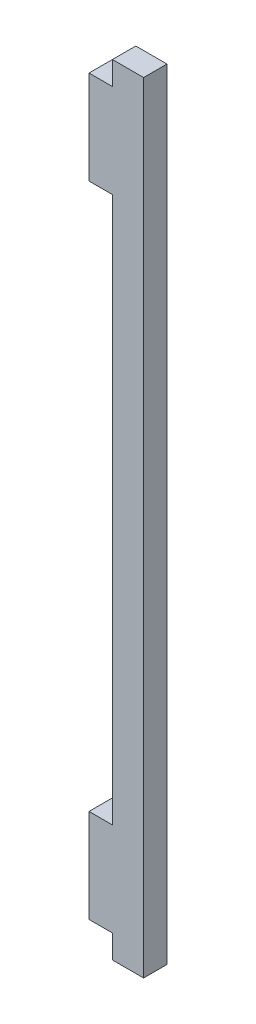
ISO-10303-21;
HEADER;
FILE_DESCRIPTION(('STEP AP214'),'2;1');
FILE_NAME('part.step','',(''),(''),'','','');
FILE_SCHEMA(('AUTOMOTIVE_DESIGN { 1 0 10303 214 1 1 1 1 }'));
ENDSEC;
DATA;
#1=APPLICATION_CONTEXT('core data for automotive mechanical design processes');
#2=APPLICATION_PROTOCOL_DEFINITION('international standard','automotive_design',2000,#1);
#3=PRODUCT_CONTEXT('',#1,'mechanical');
#4=PRODUCT('Part','Part','',(#3));
#5=PRODUCT_RELATED_PRODUCT_CATEGORY('part','',(#4));
#6=PRODUCT_DEFINITION_FORMATION('','',#4);
#7=PRODUCT_DEFINITION_CONTEXT('part definition',#1,'design');
#8=PRODUCT_DEFINITION('design','',#6,#7);
#9=PRODUCT_DEFINITION_SHAPE('','',#8);
#10=(LENGTH_UNIT() NAMED_UNIT(*) SI_UNIT(.MILLI.,.METRE.));
#11=(NAMED_UNIT(*) PLANE_ANGLE_UNIT() SI_UNIT($,.RADIAN.));
#12=(NAMED_UNIT(*) SI_UNIT($,.STERADIAN.) SOLID_ANGLE_UNIT());
#13=UNCERTAINTY_MEASURE_WITH_UNIT(LENGTH_MEASURE(1.E-05),#10,'distance_accuracy_value','');
#14=(GEOMETRIC_REPRESENTATION_CONTEXT(3) GLOBAL_UNCERTAINTY_ASSIGNED_CONTEXT((#13)) GLOBAL_UNIT_ASSIGNED_CONTEXT((#10,
#11,#12)) REPRESENTATION_CONTEXT('',''));
#15=CARTESIAN_POINT('',(0.,0.,0.));
#16=DIRECTION('',(0.,0.,1.));
#17=DIRECTION('',(1.,0.,0.));
#18=AXIS2_PLACEMENT_3D('',#15,#16,#17);
#19=CARTESIAN_POINT('',(0.,0.,3.));
#20=DIRECTION('',(1.,0.,0.));
#21=DIRECTION('',(0.,1.,0.));
#22=AXIS2_PLACEMENT_3D('',#19,#20,#21);
#23=PLANE('',#22);
#24=DIRECTION('',(0.,-1.,0.));
#25=VECTOR('',#24,1.);
#26=CARTESIAN_POINT('',(0.,0.,0.));
#27=LINE('',#26,#25);
#28=CARTESIAN_POINT('',(0.,3.,0.));
#29=VERTEX_POINT('',#28);
#30=CARTESIAN_POINT('',(0.,0.,0.));
#31=VERTEX_POINT('',#30);
#32=EDGE_CURVE('E153',#29,#31,#27,.T.);
#33=ORIENTED_EDGE('',*,*,#32,.T.);
#34=DIRECTION('',(0.,0.,-1.));
#35=VECTOR('',#34,1.);
#36=CARTESIAN_POINT('',(0.,0.,3.));
#37=LINE('',#36,#35);
#38=CARTESIAN_POINT('',(0.,0.,3.));
#39=VERTEX_POINT('',#38);
#40=EDGE_CURVE('E11',#39,#31,#37,.T.);
#41=ORIENTED_EDGE('',*,*,#40,.F.);
#42=DIRECTION('',(0.,-1.,0.));
#43=VECTOR('',#42,1.);
#44=CARTESIAN_POINT('',(0.,0.,3.));
#45=LINE('',#44,#43);
#46=CARTESIAN_POINT('',(0.,3.,3.));
#47=VERTEX_POINT('',#46);
#48=EDGE_CURVE('E175',#47,#39,#45,.T.);
#49=ORIENTED_EDGE('',*,*,#48,.F.);
#50=DIRECTION('',(0.,0.,-1.));
#51=VECTOR('',#50,1.);
#52=CARTESIAN_POINT('',(0.,3.,3.));
#53=LINE('',#52,#51);
#54=EDGE_CURVE('E149',#47,#29,#53,.T.);
#55=ORIENTED_EDGE('',*,*,#54,.T.);
#56=EDGE_LOOP('',(#33,#41,#49,#55));
#57=FACE_BOUND('',#56,.T.);
#58=ADVANCED_FACE('F33',(#57),#23,.F.);
#59=CARTESIAN_POINT('',(0.,0.,3.));
#60=DIRECTION('',(0.,1.,0.));
#61=DIRECTION('',(0.,0.,1.));
#62=AXIS2_PLACEMENT_3D('',#59,#60,#61);
#63=PLANE('',#62);
#64=DIRECTION('',(1.,0.,0.));
#65=VECTOR('',#64,1.);
#66=CARTESIAN_POINT('',(0.,0.,0.));
#67=LINE('',#66,#65);
#68=CARTESIAN_POINT('',(4.,0.,0.));
#69=VERTEX_POINT('',#68);
#70=EDGE_CURVE('E156',#31,#69,#67,.T.);
#71=ORIENTED_EDGE('',*,*,#70,.T.);
#72=DIRECTION('',(0.,0.,-1.));
#73=VECTOR('',#72,1.);
#74=CARTESIAN_POINT('',(4.,0.,3.));
#75=LINE('',#74,#73);
#76=CARTESIAN_POINT('',(4.,0.,3.));
#77=VERTEX_POINT('',#76);
#78=EDGE_CURVE('E41',#77,#69,#75,.T.);
#79=ORIENTED_EDGE('',*,*,#78,.F.);
#80=DIRECTION('',(1.,0.,0.));
#81=VECTOR('',#80,1.);
#82=CARTESIAN_POINT('',(0.,0.,3.));
#83=LINE('',#82,#81);
#84=EDGE_CURVE('E104',#39,#77,#83,.T.);
#85=ORIENTED_EDGE('',*,*,#84,.F.);
#86=ORIENTED_EDGE('',*,*,#40,.T.);
#87=EDGE_LOOP('',(#71,#79,#85,#86));
#88=FACE_BOUND('',#87,.T.);
#89=ADVANCED_FACE('F253',(#88),#63,.F.);
#90=CARTESIAN_POINT('',(4.,0.,3.));
#91=DIRECTION('',(-1.,0.,0.));
#92=DIRECTION('',(0.,0.,1.));
#93=AXIS2_PLACEMENT_3D('',#90,#91,#92);
#94=PLANE('',#93);
#95=DIRECTION('',(0.,1.,0.));
#96=VECTOR('',#95,1.);
#97=CARTESIAN_POINT('',(4.,0.,0.));
#98=LINE('',#97,#96);
#99=CARTESIAN_POINT('',(4.,100.,0.));
#100=VERTEX_POINT('',#99);
#101=EDGE_CURVE('E158',#69,#100,#98,.T.);
#102=ORIENTED_EDGE('',*,*,#101,.T.);
#103=DIRECTION('',(0.,0.,-1.));
#104=VECTOR('',#103,1.);
#105=CARTESIAN_POINT('',(4.,100.,3.));
#106=LINE('',#105,#104);
#107=CARTESIAN_POINT('',(4.,100.,3.));
#108=VERTEX_POINT('',#107);
#109=EDGE_CURVE('E194',#108,#100,#106,.T.);
#110=ORIENTED_EDGE('',*,*,#109,.F.);
#111=DIRECTION('',(0.,1.,0.));
#112=VECTOR('',#111,1.);
#113=CARTESIAN_POINT('',(4.,0.,3.));
#114=LINE('',#113,#112);
#115=EDGE_CURVE('E202',#77,#108,#114,.T.);
#116=ORIENTED_EDGE('',*,*,#115,.F.);
#117=ORIENTED_EDGE('',*,*,#78,.T.);
#118=EDGE_LOOP('',(#102,#110,#116,#117));
#119=FACE_BOUND('',#118,.T.);
#120=ADVANCED_FACE('F200',(#119),#94,.F.);
#121=CARTESIAN_POINT('',(0.,100.,3.));
#122=DIRECTION('',(0.,-1.,0.));
#123=DIRECTION('',(0.,0.,-1.));
#124=AXIS2_PLACEMENT_3D('',#121,#122,#123);
#125=PLANE('',#124);
#126=DIRECTION('',(-1.,0.,0.));
#127=VECTOR('',#126,1.);
#128=CARTESIAN_POINT('',(0.,100.,0.));
#129=LINE('',#128,#127);
#130=CARTESIAN_POINT('',(0.,100.,0.));
#131=VERTEX_POINT('',#130);
#132=EDGE_CURVE('E160',#100,#131,#129,.T.);
#133=ORIENTED_EDGE('',*,*,#132,.T.);
#134=DIRECTION('',(0.,0.,-1.));
#135=VECTOR('',#134,1.);
#136=CARTESIAN_POINT('',(0.,100.,3.));
#137=LINE('',#136,#135);
#138=CARTESIAN_POINT('',(0.,100.,3.));
#139=VERTEX_POINT('',#138);
#140=EDGE_CURVE('E191',#139,#131,#137,.T.);
#141=ORIENTED_EDGE('',*,*,#140,.F.);
#142=DIRECTION('',(-1.,0.,0.));
#143=VECTOR('',#142,1.);
#144=CARTESIAN_POINT('',(0.,100.,3.));
#145=LINE('',#144,#143);
#146=EDGE_CURVE('E220',#108,#139,#145,.T.);
#147=ORIENTED_EDGE('',*,*,#146,.F.);
#148=ORIENTED_EDGE('',*,*,#109,.T.);
#149=EDGE_LOOP('',(#133,#141,#147,#148));
#150=FACE_BOUND('',#149,.T.);
#151=ADVANCED_FACE('F211',(#150),#125,.F.);
#152=CARTESIAN_POINT('',(0.,97.,3.));
#153=DIRECTION('',(1.,0.,0.));
#154=DIRECTION('',(0.,1.,0.));
#155=AXIS2_PLACEMENT_3D('',#152,#153,#154);
#156=PLANE('',#155);
#157=DIRECTION('',(0.,-1.,0.));
#158=VECTOR('',#157,1.);
#159=CARTESIAN_POINT('',(0.,97.,0.));
#160=LINE('',#159,#158);
#161=CARTESIAN_POINT('',(0.,97.,0.));
#162=VERTEX_POINT('',#161);
#163=EDGE_CURVE('E162',#131,#162,#160,.T.);
#164=ORIENTED_EDGE('',*,*,#163,.T.);
#165=DIRECTION('',(0.,0.,-1.));
#166=VECTOR('',#165,1.);
#167=CARTESIAN_POINT('',(0.,97.,3.));
#168=LINE('',#167,#166);
#169=CARTESIAN_POINT('',(0.,97.,3.));
#170=VERTEX_POINT('',#169);
#171=EDGE_CURVE('E188',#170,#162,#168,.T.);
#172=ORIENTED_EDGE('',*,*,#171,.F.);
#173=DIRECTION('',(0.,-1.,0.));
#174=VECTOR('',#173,1.);
#175=CARTESIAN_POINT('',(0.,97.,3.));
#176=LINE('',#175,#174);
#177=EDGE_CURVE('E217',#139,#170,#176,.T.);
#178=ORIENTED_EDGE('',*,*,#177,.F.);
#179=ORIENTED_EDGE('',*,*,#140,.T.);
#180=EDGE_LOOP('',(#164,#172,#178,#179));
#181=FACE_BOUND('',#180,.T.);
#182=ADVANCED_FACE('F215',(#181),#156,.F.);
#183=CARTESIAN_POINT('',(0.,97.,3.));
#184=DIRECTION('',(0.,-1.,0.));
#185=DIRECTION('',(0.,0.,-1.));
#186=AXIS2_PLACEMENT_3D('',#183,#184,#185);
#187=PLANE('',#186);
#188=DIRECTION('',(-1.,0.,0.));
#189=VECTOR('',#188,1.);
#190=CARTESIAN_POINT('',(0.,97.,0.));
#191=LINE('',#190,#189);
#192=CARTESIAN_POINT('',(-3.,97.,0.));
#193=VERTEX_POINT('',#192);
#194=EDGE_CURVE('E164',#162,#193,#191,.T.);
#195=ORIENTED_EDGE('',*,*,#194,.T.);
#196=DIRECTION('',(0.,0.,-1.));
#197=VECTOR('',#196,1.);
#198=CARTESIAN_POINT('',(-3.,97.,3.));
#199=LINE('',#198,#197);
#200=CARTESIAN_POINT('',(-3.,97.,3.));
#201=VERTEX_POINT('',#200);
#202=EDGE_CURVE('E185',#201,#193,#199,.T.);
#203=ORIENTED_EDGE('',*,*,#202,.F.);
#204=DIRECTION('',(-1.,0.,0.));
#205=VECTOR('',#204,1.);
#206=CARTESIAN_POINT('',(0.,97.,3.));
#207=LINE('',#206,#205);
#208=EDGE_CURVE('E219',#170,#201,#207,.T.);
#209=ORIENTED_EDGE('',*,*,#208,.F.);
#210=ORIENTED_EDGE('',*,*,#171,.T.);
#211=EDGE_LOOP('',(#195,#203,#209,#210));
#212=FACE_BOUND('',#211,.T.);
#213=ADVANCED_FACE('F266',(#212),#187,.F.);
#214=CARTESIAN_POINT('',(-3.,97.,3.));
#215=DIRECTION('',(1.,0.,0.));
#216=DIRECTION('',(0.,1.,0.));
#217=AXIS2_PLACEMENT_3D('',#214,#215,#216);
#218=PLANE('',#217);
#219=DIRECTION('',(0.,-1.,0.));
#220=VECTOR('',#219,1.);
#221=CARTESIAN_POINT('',(-3.,97.,0.));
#222=LINE('',#221,#220);
#223=CARTESIAN_POINT('',(-3.,85.,0.));
#224=VERTEX_POINT('',#223);
#225=EDGE_CURVE('E166',#193,#224,#222,.T.);
#226=ORIENTED_EDGE('',*,*,#225,.T.);
#227=DIRECTION('',(0.,0.,-1.));
#228=VECTOR('',#227,1.);
#229=CARTESIAN_POINT('',(-3.,85.,3.));
#230=LINE('',#229,#228);
#231=CARTESIAN_POINT('',(-3.,85.,3.));
#232=VERTEX_POINT('',#231);
#233=EDGE_CURVE('E182',#232,#224,#230,.T.);
#234=ORIENTED_EDGE('',*,*,#233,.F.);
#235=DIRECTION('',(0.,-1.,0.));
#236=VECTOR('',#235,1.);
#237=CARTESIAN_POINT('',(-3.,97.,3.));
#238=LINE('',#237,#236);
#239=EDGE_CURVE('E222',#201,#232,#238,.T.);
#240=ORIENTED_EDGE('',*,*,#239,.F.);
#241=ORIENTED_EDGE('',*,*,#202,.T.);
#242=EDGE_LOOP('',(#226,#234,#240,#241));
#243=FACE_BOUND('',#242,.T.);
#244=ADVANCED_FACE('F269',(#243),#218,.F.);
#245=CARTESIAN_POINT('',(0.,85.,3.));
#246=DIRECTION('',(0.,1.,0.));
#247=DIRECTION('',(0.,0.,1.));
#248=AXIS2_PLACEMENT_3D('',#245,#246,#247);
#249=PLANE('',#248);
#250=DIRECTION('',(1.,0.,0.));
#251=VECTOR('',#250,1.);
#252=CARTESIAN_POINT('',(0.,85.,0.));
#253=LINE('',#252,#251);
#254=CARTESIAN_POINT('',(0.,85.,0.));
#255=VERTEX_POINT('',#254);
#256=EDGE_CURVE('E168',#224,#255,#253,.T.);
#257=ORIENTED_EDGE('',*,*,#256,.T.);
#258=DIRECTION('',(0.,0.,-1.));
#259=VECTOR('',#258,1.);
#260=CARTESIAN_POINT('',(0.,85.,3.));
#261=LINE('',#260,#259);
#262=CARTESIAN_POINT('',(0.,85.,3.));
#263=VERTEX_POINT('',#262);
#264=EDGE_CURVE('E179',#263,#255,#261,.T.);
#265=ORIENTED_EDGE('',*,*,#264,.F.);
#266=DIRECTION('',(1.,0.,0.));
#267=VECTOR('',#266,1.);
#268=CARTESIAN_POINT('',(0.,85.,3.));
#269=LINE('',#268,#267);
#270=EDGE_CURVE('E228',#232,#263,#269,.T.);
#271=ORIENTED_EDGE('',*,*,#270,.F.);
#272=ORIENTED_EDGE('',*,*,#233,.T.);
#273=EDGE_LOOP('',(#257,#265,#271,#272));
#274=FACE_BOUND('',#273,.T.);
#275=ADVANCED_FACE('F234',(#274),#249,.F.);
#276=CARTESIAN_POINT('',(0.,15.,3.));
#277=DIRECTION('',(1.,0.,0.));
#278=DIRECTION('',(0.,0.,-1.));
#279=AXIS2_PLACEMENT_3D('',#276,#277,#278);
#280=PLANE('',#279);
#281=DIRECTION('',(0.,-1.,0.));
#282=VECTOR('',#281,1.);
#283=CARTESIAN_POINT('',(0.,15.,0.));
#284=LINE('',#283,#282);
#285=CARTESIAN_POINT('',(0.,15.,0.));
#286=VERTEX_POINT('',#285);
#287=EDGE_CURVE('E170',#255,#286,#284,.T.);
#288=ORIENTED_EDGE('',*,*,#287,.T.);
#289=DIRECTION('',(0.,0.,-1.));
#290=VECTOR('',#289,1.);
#291=CARTESIAN_POINT('',(0.,15.,3.));
#292=LINE('',#291,#290);
#293=CARTESIAN_POINT('',(0.,15.,3.));
#294=VERTEX_POINT('',#293);
#295=EDGE_CURVE('E144',#294,#286,#292,.T.);
#296=ORIENTED_EDGE('',*,*,#295,.F.);
#297=DIRECTION('',(0.,-1.,0.));
#298=VECTOR('',#297,1.);
#299=CARTESIAN_POINT('',(0.,15.,3.));
#300=LINE('',#299,#298);
#301=EDGE_CURVE('E135',#263,#294,#300,.T.);
#302=ORIENTED_EDGE('',*,*,#301,.F.);
#303=ORIENTED_EDGE('',*,*,#264,.T.);
#304=EDGE_LOOP('',(#288,#296,#302,#303));
#305=FACE_BOUND('',#304,.T.);
#306=ADVANCED_FACE('F238',(#305),#280,.F.);
#307=CARTESIAN_POINT('',(0.,15.,3.));
#308=DIRECTION('',(0.,-1.,0.));
#309=DIRECTION('',(0.,0.,-1.));
#310=AXIS2_PLACEMENT_3D('',#307,#308,#309);
#311=PLANE('',#310);
#312=DIRECTION('',(-1.,0.,0.));
#313=VECTOR('',#312,1.);
#314=CARTESIAN_POINT('',(0.,15.,0.));
#315=LINE('',#314,#313);
#316=CARTESIAN_POINT('',(-3.,15.,0.));
#317=VERTEX_POINT('',#316);
#318=EDGE_CURVE('E143',#286,#317,#315,.T.);
#319=ORIENTED_EDGE('',*,*,#318,.T.);
#320=DIRECTION('',(0.,0.,-1.));
#321=VECTOR('',#320,1.);
#322=CARTESIAN_POINT('',(-3.,15.,3.));
#323=LINE('',#322,#321);
#324=CARTESIAN_POINT('',(-3.,15.,3.));
#325=VERTEX_POINT('',#324);
#326=EDGE_CURVE('E140',#325,#317,#323,.T.);
#327=ORIENTED_EDGE('',*,*,#326,.F.);
#328=DIRECTION('',(-1.,0.,0.));
#329=VECTOR('',#328,1.);
#330=CARTESIAN_POINT('',(0.,15.,3.));
#331=LINE('',#330,#329);
#332=EDGE_CURVE('E129',#294,#325,#331,.T.);
#333=ORIENTED_EDGE('',*,*,#332,.F.);
#334=ORIENTED_EDGE('',*,*,#295,.T.);
#335=EDGE_LOOP('',(#319,#327,#333,#334));
#336=FACE_BOUND('',#335,.T.);
#337=ADVANCED_FACE('F141',(#336),#311,.F.);
#338=CARTESIAN_POINT('',(-3.,3.,3.));
#339=DIRECTION('',(1.,0.,0.));
#340=DIRECTION('',(0.,1.,0.));
#341=AXIS2_PLACEMENT_3D('',#338,#339,#340);
#342=PLANE('',#341);
#343=DIRECTION('',(0.,-1.,0.));
#344=VECTOR('',#343,1.);
#345=CARTESIAN_POINT('',(-3.,3.,0.));
#346=LINE('',#345,#344);
#347=CARTESIAN_POINT('',(-3.,3.,0.));
#348=VERTEX_POINT('',#347);
#349=EDGE_CURVE('E90',#317,#348,#346,.T.);
#350=ORIENTED_EDGE('',*,*,#349,.T.);
#351=DIRECTION('',(0.,0.,-1.));
#352=VECTOR('',#351,1.);
#353=CARTESIAN_POINT('',(-3.,3.,3.));
#354=LINE('',#353,#352);
#355=CARTESIAN_POINT('',(-3.,3.,3.));
#356=VERTEX_POINT('',#355);
#357=EDGE_CURVE('E145',#356,#348,#354,.T.);
#358=ORIENTED_EDGE('',*,*,#357,.F.);
#359=DIRECTION('',(0.,-1.,0.));
#360=VECTOR('',#359,1.);
#361=CARTESIAN_POINT('',(-3.,3.,3.));
#362=LINE('',#361,#360);
#363=EDGE_CURVE('E133',#325,#356,#362,.T.);
#364=ORIENTED_EDGE('',*,*,#363,.F.);
#365=ORIENTED_EDGE('',*,*,#326,.T.);
#366=EDGE_LOOP('',(#350,#358,#364,#365));
#367=FACE_BOUND('',#366,.T.);
#368=ADVANCED_FACE('F147',(#367),#342,.F.);
#369=CARTESIAN_POINT('',(0.,3.,3.));
#370=DIRECTION('',(0.,1.,0.));
#371=DIRECTION('',(0.,0.,1.));
#372=AXIS2_PLACEMENT_3D('',#369,#370,#371);
#373=PLANE('',#372);
#374=DIRECTION('',(1.,0.,0.));
#375=VECTOR('',#374,1.);
#376=CARTESIAN_POINT('',(0.,3.,0.));
#377=LINE('',#376,#375);
#378=EDGE_CURVE('E96',#348,#29,#377,.T.);
#379=ORIENTED_EDGE('',*,*,#378,.T.);
#380=ORIENTED_EDGE('',*,*,#54,.F.);
#381=DIRECTION('',(1.,0.,0.));
#382=VECTOR('',#381,1.);
#383=CARTESIAN_POINT('',(0.,3.,3.));
#384=LINE('',#383,#382);
#385=EDGE_CURVE('E49',#356,#47,#384,.T.);
#386=ORIENTED_EDGE('',*,*,#385,.F.);
#387=ORIENTED_EDGE('',*,*,#357,.T.);
#388=EDGE_LOOP('',(#379,#380,#386,#387));
#389=FACE_BOUND('',#388,.T.);
#390=ADVANCED_FACE('F242',(#389),#373,.F.);
#391=CARTESIAN_POINT('',(0.,0.,3.));
#392=DIRECTION('',(0.,0.,1.));
#393=DIRECTION('',(1.,0.,0.));
#394=AXIS2_PLACEMENT_3D('',#391,#392,#393);
#395=PLANE('',#394);
#396=ORIENTED_EDGE('',*,*,#48,.T.);
#397=ORIENTED_EDGE('',*,*,#84,.T.);
#398=ORIENTED_EDGE('',*,*,#115,.T.);
#399=ORIENTED_EDGE('',*,*,#146,.T.);
#400=ORIENTED_EDGE('',*,*,#177,.T.);
#401=ORIENTED_EDGE('',*,*,#208,.T.);
#402=ORIENTED_EDGE('',*,*,#239,.T.);
#403=ORIENTED_EDGE('',*,*,#270,.T.);
#404=ORIENTED_EDGE('',*,*,#301,.T.);
#405=ORIENTED_EDGE('',*,*,#332,.T.);
#406=ORIENTED_EDGE('',*,*,#363,.T.);
#407=ORIENTED_EDGE('',*,*,#385,.T.);
#408=EDGE_LOOP('',(#396,#397,#398,#399,#400,#401,#402,#403,#404,#405,#406,#407));
#409=FACE_BOUND('',#408,.T.);
#410=ADVANCED_FACE('F131',(#409),#395,.T.);
#411=CARTESIAN_POINT('',(0.,0.,0.));
#412=DIRECTION('',(0.,0.,1.));
#413=DIRECTION('',(1.,0.,0.));
#414=AXIS2_PLACEMENT_3D('',#411,#412,#413);
#415=PLANE('',#414);
#416=ORIENTED_EDGE('',*,*,#32,.F.);
#417=ORIENTED_EDGE('',*,*,#378,.F.);
#418=ORIENTED_EDGE('',*,*,#349,.F.);
#419=ORIENTED_EDGE('',*,*,#318,.F.);
#420=ORIENTED_EDGE('',*,*,#287,.F.);
#421=ORIENTED_EDGE('',*,*,#256,.F.);
#422=ORIENTED_EDGE('',*,*,#225,.F.);
#423=ORIENTED_EDGE('',*,*,#194,.F.);
#424=ORIENTED_EDGE('',*,*,#163,.F.);
#425=ORIENTED_EDGE('',*,*,#132,.F.);
#426=ORIENTED_EDGE('',*,*,#101,.F.);
#427=ORIENTED_EDGE('',*,*,#70,.F.);
#428=EDGE_LOOP('',(#416,#417,#418,#419,#420,#421,#422,#423,#424,#425,#426,#427));
#429=FACE_BOUND('',#428,.T.);
#430=ADVANCED_FACE('F206',(#429),#415,.F.);
#431=CLOSED_SHELL('',(#58,#89,#120,#151,#182,#213,#244,#275,#306,#337,#368,#390,#410,#430));
#432=MANIFOLD_SOLID_BREP('B2',#431);
#433=ADVANCED_BREP_SHAPE_REPRESENTATION('',(#18,#432),#14);
#434=SHAPE_DEFINITION_REPRESENTATION(#9,#433);
ENDSEC;
END-ISO-10303-21;
